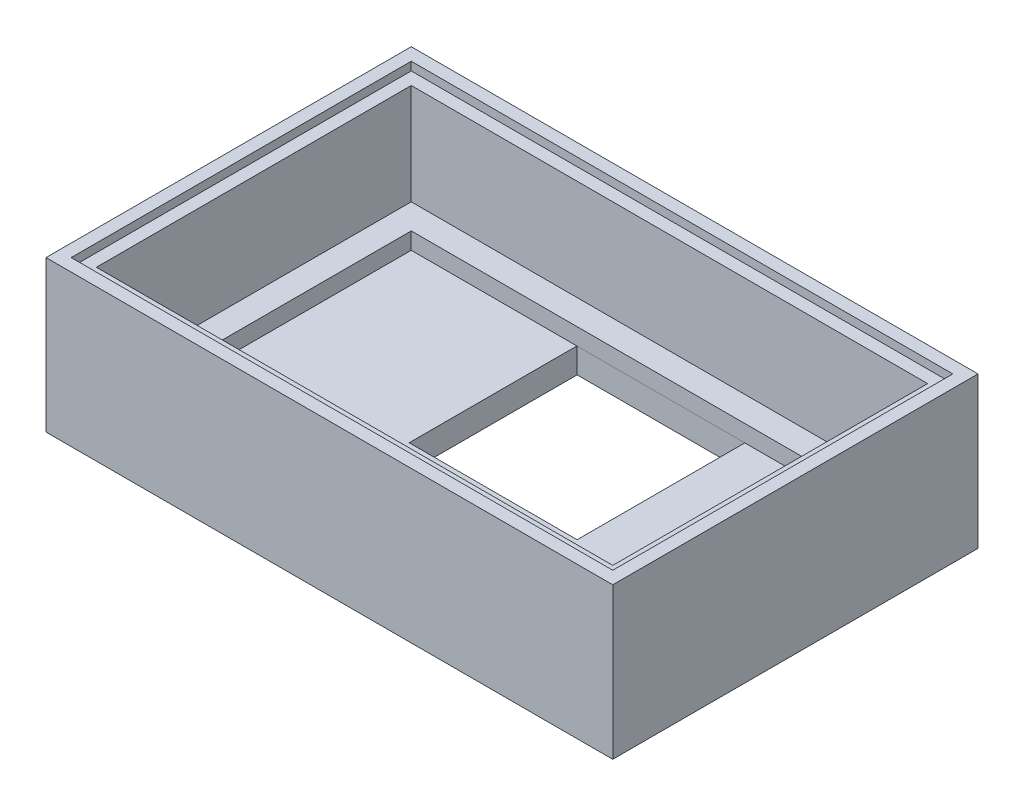
ISO-10303-21;
HEADER;
FILE_DESCRIPTION(('STEP AP214'),'2;1');
FILE_NAME('part.step','',(''),(''),'','','');
FILE_SCHEMA(('AUTOMOTIVE_DESIGN { 1 0 10303 214 1 1 1 1 }'));
ENDSEC;
DATA;
#1=APPLICATION_CONTEXT('core data for automotive mechanical design processes');
#2=APPLICATION_PROTOCOL_DEFINITION('international standard','automotive_design',2000,#1);
#3=PRODUCT_CONTEXT('',#1,'mechanical');
#4=PRODUCT('Part','Part','',(#3));
#5=PRODUCT_RELATED_PRODUCT_CATEGORY('part','',(#4));
#6=PRODUCT_DEFINITION_FORMATION('','',#4);
#7=PRODUCT_DEFINITION_CONTEXT('part definition',#1,'design');
#8=PRODUCT_DEFINITION('design','',#6,#7);
#9=PRODUCT_DEFINITION_SHAPE('','',#8);
#10=(LENGTH_UNIT() NAMED_UNIT(*) SI_UNIT(.MILLI.,.METRE.));
#11=(NAMED_UNIT(*) PLANE_ANGLE_UNIT() SI_UNIT($,.RADIAN.));
#12=(NAMED_UNIT(*) SI_UNIT($,.STERADIAN.) SOLID_ANGLE_UNIT());
#13=UNCERTAINTY_MEASURE_WITH_UNIT(LENGTH_MEASURE(1.E-05),#10,'distance_accuracy_value','');
#14=(GEOMETRIC_REPRESENTATION_CONTEXT(3) GLOBAL_UNCERTAINTY_ASSIGNED_CONTEXT((#13)) GLOBAL_UNIT_ASSIGNED_CONTEXT((#10,
#11,#12)) REPRESENTATION_CONTEXT('',''));
#15=CARTESIAN_POINT('',(0.,0.,0.));
#16=DIRECTION('',(0.,0.,1.));
#17=DIRECTION('',(1.,0.,0.));
#18=AXIS2_PLACEMENT_3D('',#15,#16,#17);
#19=CARTESIAN_POINT('',(-59.1872601006215,15.,0.0820946037709573));
#20=DIRECTION('',(1.,0.,0.));
#21=DIRECTION('',(0.,0.,-1.));
#22=AXIS2_PLACEMENT_3D('',#19,#20,#21);
#23=PLANE('',#22);
#24=DIRECTION('',(0.,-1.,0.));
#25=VECTOR('',#24,1.);
#26=CARTESIAN_POINT('',(-59.1872601006215,15.,0.0820946037709573));
#27=LINE('',#26,#25);
#28=CARTESIAN_POINT('',(-59.1872601006215,14.,0.0820946037709573));
#29=VERTEX_POINT('',#28);
#30=CARTESIAN_POINT('',(-59.1872601006215,2.,0.0820946037709573));
#31=VERTEX_POINT('',#30);
#32=EDGE_CURVE('E375',#29,#31,#27,.T.);
#33=ORIENTED_EDGE('',*,*,#32,.F.);
#34=DIRECTION('',(0.,0.,1.));
#35=VECTOR('',#34,1.);
#36=CARTESIAN_POINT('',(-59.1872601006215,14.,0.0820946037709573));
#37=LINE('',#36,#35);
#38=CARTESIAN_POINT('',(-59.1872601006215,14.,37.5820946037689));
#39=VERTEX_POINT('',#38);
#40=EDGE_CURVE('E325',#29,#39,#37,.T.);
#41=ORIENTED_EDGE('',*,*,#40,.T.);
#42=DIRECTION('',(0.,-1.,0.));
#43=VECTOR('',#42,1.);
#44=CARTESIAN_POINT('',(-59.1872601006215,15.,37.5820946037689));
#45=LINE('',#44,#43);
#46=CARTESIAN_POINT('',(-59.1872601006215,2.,37.5820946037689));
#47=VERTEX_POINT('',#46);
#48=EDGE_CURVE('E378',#39,#47,#45,.T.);
#49=ORIENTED_EDGE('',*,*,#48,.T.);
#50=DIRECTION('',(0.,0.,1.));
#51=VECTOR('',#50,1.);
#52=CARTESIAN_POINT('',(-59.1872601006215,2.,0.0820946037709573));
#53=LINE('',#52,#51);
#54=EDGE_CURVE('E91',#31,#47,#53,.T.);
#55=ORIENTED_EDGE('',*,*,#54,.F.);
#56=EDGE_LOOP('',(#33,#41,#49,#55));
#57=FACE_BOUND('',#56,.T.);
#58=ADVANCED_FACE('F83',(#57),#23,.T.);
#59=CARTESIAN_POINT('',(2.31273989937717,15.,0.0820946037709573));
#60=DIRECTION('',(1.,0.,0.));
#61=DIRECTION('',(0.,0.,-1.));
#62=AXIS2_PLACEMENT_3D('',#59,#60,#61);
#63=PLANE('',#62);
#64=DIRECTION('',(0.,0.,1.));
#65=VECTOR('',#64,1.);
#66=CARTESIAN_POINT('',(2.31273989937717,14.,0.0820946037709573));
#67=LINE('',#66,#65);
#68=CARTESIAN_POINT('',(2.31273989937717,14.,0.0820946037709573));
#69=VERTEX_POINT('',#68);
#70=CARTESIAN_POINT('',(2.31273989937719,14.,37.5820946037689));
#71=VERTEX_POINT('',#70);
#72=EDGE_CURVE('E317',#69,#71,#67,.T.);
#73=ORIENTED_EDGE('',*,*,#72,.F.);
#74=DIRECTION('',(0.,-1.,0.));
#75=VECTOR('',#74,1.);
#76=CARTESIAN_POINT('',(2.31273989937717,15.,0.0820946037709573));
#77=LINE('',#76,#75);
#78=CARTESIAN_POINT('',(2.31273989937717,2.,0.0820946037709573));
#79=VERTEX_POINT('',#78);
#80=EDGE_CURVE('E374',#69,#79,#77,.T.);
#81=ORIENTED_EDGE('',*,*,#80,.T.);
#82=DIRECTION('',(0.,0.,1.));
#83=VECTOR('',#82,1.);
#84=CARTESIAN_POINT('',(2.31273989937717,2.,0.0820946037709573));
#85=LINE('',#84,#83);
#86=CARTESIAN_POINT('',(2.31273989937719,2.,37.5820946037689));
#87=VERTEX_POINT('',#86);
#88=EDGE_CURVE('E437',#79,#87,#85,.T.);
#89=ORIENTED_EDGE('',*,*,#88,.T.);
#90=DIRECTION('',(0.,-1.,0.));
#91=VECTOR('',#90,1.);
#92=CARTESIAN_POINT('',(2.31273989937719,15.,37.5820946037689));
#93=LINE('',#92,#91);
#94=EDGE_CURVE('E380',#71,#87,#93,.T.);
#95=ORIENTED_EDGE('',*,*,#94,.F.);
#96=EDGE_LOOP('',(#73,#81,#89,#95));
#97=FACE_BOUND('',#96,.T.);
#98=ADVANCED_FACE('F457',(#97),#63,.F.);
#99=CARTESIAN_POINT('',(-59.1872601006215,15.,0.0820946037709573));
#100=DIRECTION('',(0.,0.,-1.));
#101=DIRECTION('',(-1.,0.,0.));
#102=AXIS2_PLACEMENT_3D('',#99,#100,#101);
#103=PLANE('',#102);
#104=DIRECTION('',(1.,0.,0.));
#105=VECTOR('',#104,1.);
#106=CARTESIAN_POINT('',(-59.1872601006215,14.,0.0820946037709573));
#107=LINE('',#106,#105);
#108=EDGE_CURVE('E328',#29,#69,#107,.T.);
#109=ORIENTED_EDGE('',*,*,#108,.F.);
#110=ORIENTED_EDGE('',*,*,#32,.T.);
#111=DIRECTION('',(1.,0.,0.));
#112=VECTOR('',#111,1.);
#113=CARTESIAN_POINT('',(-59.1872601006215,2.,0.0820946037709573));
#114=LINE('',#113,#112);
#115=EDGE_CURVE('E434',#31,#79,#114,.T.);
#116=ORIENTED_EDGE('',*,*,#115,.T.);
#117=ORIENTED_EDGE('',*,*,#80,.F.);
#118=EDGE_LOOP('',(#109,#110,#116,#117));
#119=FACE_BOUND('',#118,.T.);
#120=ADVANCED_FACE('F461',(#119),#103,.F.);
#121=CARTESIAN_POINT('',(-59.1872601006215,15.,37.5820946037689));
#122=DIRECTION('',(0.,0.,-1.));
#123=DIRECTION('',(-1.,0.,0.));
#124=AXIS2_PLACEMENT_3D('',#121,#122,#123);
#125=PLANE('',#124);
#126=ORIENTED_EDGE('',*,*,#48,.F.);
#127=DIRECTION('',(1.,0.,0.));
#128=VECTOR('',#127,1.);
#129=CARTESIAN_POINT('',(-59.1872601006215,14.,37.5820946037689));
#130=LINE('',#129,#128);
#131=EDGE_CURVE('E12',#39,#71,#130,.T.);
#132=ORIENTED_EDGE('',*,*,#131,.T.);
#133=ORIENTED_EDGE('',*,*,#94,.T.);
#134=DIRECTION('',(1.,0.,0.));
#135=VECTOR('',#134,1.);
#136=CARTESIAN_POINT('',(-59.1872601006215,2.,37.5820946037689));
#137=LINE('',#136,#135);
#138=EDGE_CURVE('E440',#47,#87,#137,.T.);
#139=ORIENTED_EDGE('',*,*,#138,.F.);
#140=EDGE_LOOP('',(#126,#132,#133,#139));
#141=FACE_BOUND('',#140,.T.);
#142=ADVANCED_FACE('F453',(#141),#125,.T.);
#143=CARTESIAN_POINT('',(0.,-3.,0.));
#144=DIRECTION('',(0.,1.,0.));
#145=DIRECTION('',(0.,0.,1.));
#146=AXIS2_PLACEMENT_3D('',#143,#144,#145);
#147=PLANE('',#146);
#148=DIRECTION('',(-1.,0.,0.));
#149=VECTOR('',#148,1.);
#150=CARTESIAN_POINT('',(-36.4581734004143,-3.,3.05472973584662));
#151=LINE('',#150,#149);
#152=CARTESIAN_POINT('',(-16.4581734004143,-3.,3.05472973584662));
#153=VERTEX_POINT('',#152);
#154=CARTESIAN_POINT('',(-36.4581734004143,-3.,3.05472973584662));
#155=VERTEX_POINT('',#154);
#156=EDGE_CURVE('E262',#153,#155,#151,.T.);
#157=ORIENTED_EDGE('',*,*,#156,.T.);
#158=DIRECTION('',(0.,0.,1.));
#159=VECTOR('',#158,1.);
#160=CARTESIAN_POINT('',(-36.4581734004143,-3.,3.05472973584662));
#161=LINE('',#160,#159);
#162=CARTESIAN_POINT('',(-36.4581734004143,-3.,23.0547297358466));
#163=VERTEX_POINT('',#162);
#164=EDGE_CURVE('E254',#155,#163,#161,.T.);
#165=ORIENTED_EDGE('',*,*,#164,.T.);
#166=DIRECTION('',(1.,0.,0.));
#167=VECTOR('',#166,1.);
#168=CARTESIAN_POINT('',(-36.4581734004143,-3.,23.0547297358466));
#169=LINE('',#168,#167);
#170=CARTESIAN_POINT('',(-16.4581734004143,-3.,23.0547297358466));
#171=VERTEX_POINT('',#170);
#172=EDGE_CURVE('E265',#163,#171,#169,.T.);
#173=ORIENTED_EDGE('',*,*,#172,.T.);
#174=DIRECTION('',(0.,0.,-1.));
#175=VECTOR('',#174,1.);
#176=CARTESIAN_POINT('',(-16.4581734004143,-3.,3.05472973584662));
#177=LINE('',#176,#175);
#178=EDGE_CURVE('E98',#171,#153,#177,.T.);
#179=ORIENTED_EDGE('',*,*,#178,.T.);
#180=EDGE_LOOP('',(#157,#165,#173,#179));
#181=FACE_BOUND('',#180,.T.);
#182=DIRECTION('',(0.,0.,1.));
#183=VECTOR('',#182,1.);
#184=CARTESIAN_POINT('',(-62.1872601006215,-3.,-2.91790539622904));
#185=LINE('',#184,#183);
#186=CARTESIAN_POINT('',(-62.1872601006215,-3.,-2.91790539622904));
#187=VERTEX_POINT('',#186);
#188=CARTESIAN_POINT('',(-62.1872601006215,-3.,40.5820946037689));
#189=VERTEX_POINT('',#188);
#190=EDGE_CURVE('E362',#187,#189,#185,.T.);
#191=ORIENTED_EDGE('',*,*,#190,.F.);
#192=DIRECTION('',(1.,0.,0.));
#193=VECTOR('',#192,1.);
#194=CARTESIAN_POINT('',(-62.1872601006215,-3.,-2.91790539622904));
#195=LINE('',#194,#193);
#196=CARTESIAN_POINT('',(5.31273989937717,-3.,-2.91790539622904));
#197=VERTEX_POINT('',#196);
#198=EDGE_CURVE('E371',#187,#197,#195,.T.);
#199=ORIENTED_EDGE('',*,*,#198,.T.);
#200=DIRECTION('',(0.,0.,1.));
#201=VECTOR('',#200,1.);
#202=CARTESIAN_POINT('',(5.31273989937717,-3.,-2.91790539622904));
#203=LINE('',#202,#201);
#204=CARTESIAN_POINT('',(5.31273989937717,-3.,40.5820946037689));
#205=VERTEX_POINT('',#204);
#206=EDGE_CURVE('E368',#197,#205,#203,.T.);
#207=ORIENTED_EDGE('',*,*,#206,.T.);
#208=DIRECTION('',(1.,0.,0.));
#209=VECTOR('',#208,1.);
#210=CARTESIAN_POINT('',(-62.1872601006215,-3.,40.5820946037689));
#211=LINE('',#210,#209);
#212=EDGE_CURVE('E365',#189,#205,#211,.T.);
#213=ORIENTED_EDGE('',*,*,#212,.F.);
#214=EDGE_LOOP('',(#191,#199,#207,#213));
#215=FACE_BOUND('',#214,.T.);
#216=DIRECTION('',(0.,0.,1.));
#217=VECTOR('',#216,1.);
#218=CARTESIAN_POINT('',(-9.68726010062283,-3.,0.));
#219=LINE('',#218,#217);
#220=CARTESIAN_POINT('',(-9.68726010062283,-3.,30.5320946037689));
#221=VERTEX_POINT('',#220);
#222=CARTESIAN_POINT('',(-9.68726010062283,-3.,35.0320946037689));
#223=VERTEX_POINT('',#222);
#224=EDGE_CURVE('E335',#221,#223,#219,.T.);
#225=ORIENTED_EDGE('',*,*,#224,.T.);
#226=DIRECTION('',(1.,0.,0.));
#227=VECTOR('',#226,1.);
#228=CARTESIAN_POINT('',(0.,-3.,35.0320946037689));
#229=LINE('',#228,#227);
#230=CARTESIAN_POINT('',(-5.18726010062283,-3.,35.0320946037689));
#231=VERTEX_POINT('',#230);
#232=EDGE_CURVE('E353',#223,#231,#229,.T.);
#233=ORIENTED_EDGE('',*,*,#232,.T.);
#234=DIRECTION('',(0.,0.,1.));
#235=VECTOR('',#234,1.);
#236=CARTESIAN_POINT('',(-5.18726010062283,-3.,0.));
#237=LINE('',#236,#235);
#238=CARTESIAN_POINT('',(-5.18726010062283,-3.,30.5320946037689));
#239=VERTEX_POINT('',#238);
#240=EDGE_CURVE('E330',#239,#231,#237,.T.);
#241=ORIENTED_EDGE('',*,*,#240,.F.);
#242=DIRECTION('',(1.,0.,0.));
#243=VECTOR('',#242,1.);
#244=CARTESIAN_POINT('',(0.,-3.,30.5320946037689));
#245=LINE('',#244,#243);
#246=EDGE_CURVE('E333',#221,#239,#245,.T.);
#247=ORIENTED_EDGE('',*,*,#246,.F.);
#248=EDGE_LOOP('',(#225,#233,#241,#247));
#249=FACE_BOUND('',#248,.T.);
#250=ADVANCED_FACE('F269',(#181,#215,#249),#147,.F.);
#251=CARTESIAN_POINT('',(0.,0.,0.));
#252=DIRECTION('',(0.,1.,0.));
#253=DIRECTION('',(0.,0.,1.));
#254=AXIS2_PLACEMENT_3D('',#251,#252,#253);
#255=PLANE('',#254);
#256=DIRECTION('',(0.,0.,1.));
#257=VECTOR('',#256,1.);
#258=CARTESIAN_POINT('',(-36.4581734004143,0.,3.05472973584662));
#259=LINE('',#258,#257);
#260=CARTESIAN_POINT('',(-36.4581734004143,0.,3.08209460377096));
#261=VERTEX_POINT('',#260);
#262=CARTESIAN_POINT('',(-36.4581734004143,0.,23.0547297358466));
#263=VERTEX_POINT('',#262);
#264=EDGE_CURVE('E257',#261,#263,#259,.T.);
#265=ORIENTED_EDGE('',*,*,#264,.F.);
#266=DIRECTION('',(1.,0.,0.));
#267=VECTOR('',#266,1.);
#268=CARTESIAN_POINT('',(-56.1872601006215,0.,3.08209460377096));
#269=LINE('',#268,#267);
#270=CARTESIAN_POINT('',(-56.1872601006215,0.,3.08209460377096));
#271=VERTEX_POINT('',#270);
#272=EDGE_CURVE('E404',#271,#261,#269,.T.);
#273=ORIENTED_EDGE('',*,*,#272,.F.);
#274=DIRECTION('',(0.,0.,1.));
#275=VECTOR('',#274,1.);
#276=CARTESIAN_POINT('',(-56.1872601006215,0.,3.08209460377096));
#277=LINE('',#276,#275);
#278=CARTESIAN_POINT('',(-56.1872601006215,0.,36.0820946037689));
#279=VERTEX_POINT('',#278);
#280=EDGE_CURVE('E395',#271,#279,#277,.T.);
#281=ORIENTED_EDGE('',*,*,#280,.T.);
#282=DIRECTION('',(1.,0.,0.));
#283=VECTOR('',#282,1.);
#284=CARTESIAN_POINT('',(-56.1872601006215,0.,36.0820946037689));
#285=LINE('',#284,#283);
#286=CARTESIAN_POINT('',(-0.687260100622811,0.,36.0820946037689));
#287=VERTEX_POINT('',#286);
#288=EDGE_CURVE('E414',#279,#287,#285,.T.);
#289=ORIENTED_EDGE('',*,*,#288,.T.);
#290=DIRECTION('',(0.,0.,1.));
#291=VECTOR('',#290,1.);
#292=CARTESIAN_POINT('',(-0.687260100622825,0.,3.08209460377096));
#293=LINE('',#292,#291);
#294=CARTESIAN_POINT('',(-0.687260100622825,0.,3.08209460377096));
#295=VERTEX_POINT('',#294);
#296=EDGE_CURVE('E416',#295,#287,#293,.T.);
#297=ORIENTED_EDGE('',*,*,#296,.F.);
#298=CARTESIAN_POINT('',(-16.4581734004143,0.,3.08209460377096));
#299=VERTEX_POINT('',#298);
#300=EDGE_CURVE('E419',#299,#295,#269,.T.);
#301=ORIENTED_EDGE('',*,*,#300,.F.);
#302=DIRECTION('',(0.,0.,-1.));
#303=VECTOR('',#302,1.);
#304=CARTESIAN_POINT('',(-16.4581734004143,0.,3.05472973584662));
#305=LINE('',#304,#303);
#306=CARTESIAN_POINT('',(-16.4581734004143,0.,23.0547297358466));
#307=VERTEX_POINT('',#306);
#308=EDGE_CURVE('E104',#307,#299,#305,.T.);
#309=ORIENTED_EDGE('',*,*,#308,.F.);
#310=DIRECTION('',(1.,0.,0.));
#311=VECTOR('',#310,1.);
#312=CARTESIAN_POINT('',(-36.4581734004143,0.,23.0547297358466));
#313=LINE('',#312,#311);
#314=EDGE_CURVE('E281',#263,#307,#313,.T.);
#315=ORIENTED_EDGE('',*,*,#314,.F.);
#316=EDGE_LOOP('',(#265,#273,#281,#289,#297,#301,#309,#315));
#317=FACE_BOUND('',#316,.T.);
#318=DIRECTION('',(-1.,0.,0.));
#319=VECTOR('',#318,1.);
#320=CARTESIAN_POINT('',(0.,0.,35.0320946037689));
#321=LINE('',#320,#319);
#322=CARTESIAN_POINT('',(-5.18726010062283,0.,35.0320946037689));
#323=VERTEX_POINT('',#322);
#324=CARTESIAN_POINT('',(-9.68726010062283,0.,35.0320946037689));
#325=VERTEX_POINT('',#324);
#326=EDGE_CURVE('E341',#323,#325,#321,.T.);
#327=ORIENTED_EDGE('',*,*,#326,.T.);
#328=DIRECTION('',(0.,0.,-1.));
#329=VECTOR('',#328,1.);
#330=CARTESIAN_POINT('',(-9.68726010062283,0.,0.));
#331=LINE('',#330,#329);
#332=CARTESIAN_POINT('',(-9.68726010062283,0.,30.5320946037689));
#333=VERTEX_POINT('',#332);
#334=EDGE_CURVE('E338',#325,#333,#331,.T.);
#335=ORIENTED_EDGE('',*,*,#334,.T.);
#336=DIRECTION('',(-1.,0.,0.));
#337=VECTOR('',#336,1.);
#338=CARTESIAN_POINT('',(0.,0.,30.5320946037689));
#339=LINE('',#338,#337);
#340=CARTESIAN_POINT('',(-5.18726010062283,0.,30.5320946037689));
#341=VERTEX_POINT('',#340);
#342=EDGE_CURVE('E347',#341,#333,#339,.T.);
#343=ORIENTED_EDGE('',*,*,#342,.F.);
#344=DIRECTION('',(0.,0.,-1.));
#345=VECTOR('',#344,1.);
#346=CARTESIAN_POINT('',(-5.18726010062283,0.,0.));
#347=LINE('',#346,#345);
#348=EDGE_CURVE('E344',#323,#341,#347,.T.);
#349=ORIENTED_EDGE('',*,*,#348,.F.);
#350=EDGE_LOOP('',(#327,#335,#343,#349));
#351=FACE_BOUND('',#350,.T.);
#352=ADVANCED_FACE('F489',(#317,#351),#255,.T.);
#353=CARTESIAN_POINT('',(0.,2.,0.));
#354=DIRECTION('',(0.,-1.,0.));
#355=DIRECTION('',(0.,0.,-1.));
#356=AXIS2_PLACEMENT_3D('',#353,#354,#355);
#357=PLANE('',#356);
#358=ORIENTED_EDGE('',*,*,#115,.F.);
#359=ORIENTED_EDGE('',*,*,#54,.T.);
#360=ORIENTED_EDGE('',*,*,#138,.T.);
#361=ORIENTED_EDGE('',*,*,#88,.F.);
#362=EDGE_LOOP('',(#358,#359,#360,#361));
#363=FACE_BOUND('',#362,.T.);
#364=DIRECTION('',(0.,0.,1.));
#365=VECTOR('',#364,1.);
#366=CARTESIAN_POINT('',(-56.1872601006215,2.,3.08209460377096));
#367=LINE('',#366,#365);
#368=CARTESIAN_POINT('',(-56.1872601006215,2.,3.08209460377096));
#369=VERTEX_POINT('',#368);
#370=CARTESIAN_POINT('',(-56.1872601006215,2.,36.0820946037689));
#371=VERTEX_POINT('',#370);
#372=EDGE_CURVE('E401',#369,#371,#367,.T.);
#373=ORIENTED_EDGE('',*,*,#372,.F.);
#374=DIRECTION('',(1.,0.,0.));
#375=VECTOR('',#374,1.);
#376=CARTESIAN_POINT('',(-56.1872601006215,2.,3.08209460377096));
#377=LINE('',#376,#375);
#378=CARTESIAN_POINT('',(-0.687260100622825,2.,3.08209460377096));
#379=VERTEX_POINT('',#378);
#380=EDGE_CURVE('E409',#369,#379,#377,.T.);
#381=ORIENTED_EDGE('',*,*,#380,.T.);
#382=DIRECTION('',(0.,0.,1.));
#383=VECTOR('',#382,1.);
#384=CARTESIAN_POINT('',(-0.687260100622825,2.,3.08209460377096));
#385=LINE('',#384,#383);
#386=CARTESIAN_POINT('',(-0.687260100622811,2.,36.0820946037689));
#387=VERTEX_POINT('',#386);
#388=EDGE_CURVE('E406',#379,#387,#385,.T.);
#389=ORIENTED_EDGE('',*,*,#388,.T.);
#390=DIRECTION('',(1.,0.,0.));
#391=VECTOR('',#390,1.);
#392=CARTESIAN_POINT('',(-56.1872601006215,2.,36.0820946037689));
#393=LINE('',#392,#391);
#394=EDGE_CURVE('E403',#371,#387,#393,.T.);
#395=ORIENTED_EDGE('',*,*,#394,.F.);
#396=EDGE_LOOP('',(#373,#381,#389,#395));
#397=FACE_BOUND('',#396,.T.);
#398=ADVANCED_FACE('F85',(#363,#397),#357,.F.);
#399=CARTESIAN_POINT('',(-56.1872601006215,2.,3.08209460377096));
#400=DIRECTION('',(1.,0.,0.));
#401=DIRECTION('',(0.,0.,-1.));
#402=AXIS2_PLACEMENT_3D('',#399,#400,#401);
#403=PLANE('',#402);
#404=ORIENTED_EDGE('',*,*,#280,.F.);
#405=DIRECTION('',(0.,-1.,0.));
#406=VECTOR('',#405,1.);
#407=CARTESIAN_POINT('',(-56.1872601006215,2.,3.08209460377096));
#408=LINE('',#407,#406);
#409=EDGE_CURVE('E412',#369,#271,#408,.T.);
#410=ORIENTED_EDGE('',*,*,#409,.F.);
#411=ORIENTED_EDGE('',*,*,#372,.T.);
#412=DIRECTION('',(0.,-1.,0.));
#413=VECTOR('',#412,1.);
#414=CARTESIAN_POINT('',(-56.1872601006215,2.,36.0820946037689));
#415=LINE('',#414,#413);
#416=EDGE_CURVE('E431',#371,#279,#415,.T.);
#417=ORIENTED_EDGE('',*,*,#416,.T.);
#418=EDGE_LOOP('',(#404,#410,#411,#417));
#419=FACE_BOUND('',#418,.T.);
#420=ADVANCED_FACE('F526',(#419),#403,.T.);
#421=CARTESIAN_POINT('',(-56.1872601006215,2.,36.0820946037689));
#422=DIRECTION('',(0.,0.,-1.));
#423=DIRECTION('',(-1.,0.,0.));
#424=AXIS2_PLACEMENT_3D('',#421,#422,#423);
#425=PLANE('',#424);
#426=ORIENTED_EDGE('',*,*,#288,.F.);
#427=ORIENTED_EDGE('',*,*,#416,.F.);
#428=ORIENTED_EDGE('',*,*,#394,.T.);
#429=DIRECTION('',(0.,-1.,0.));
#430=VECTOR('',#429,1.);
#431=CARTESIAN_POINT('',(-0.687260100622811,2.,36.0820946037689));
#432=LINE('',#431,#430);
#433=EDGE_CURVE('E428',#387,#287,#432,.T.);
#434=ORIENTED_EDGE('',*,*,#433,.T.);
#435=EDGE_LOOP('',(#426,#427,#428,#434));
#436=FACE_BOUND('',#435,.T.);
#437=ADVANCED_FACE('F523',(#436),#425,.T.);
#438=CARTESIAN_POINT('',(-0.687260100622825,2.,3.08209460377096));
#439=DIRECTION('',(1.,0.,0.));
#440=DIRECTION('',(0.,0.,-1.));
#441=AXIS2_PLACEMENT_3D('',#438,#439,#440);
#442=PLANE('',#441);
#443=ORIENTED_EDGE('',*,*,#296,.T.);
#444=ORIENTED_EDGE('',*,*,#433,.F.);
#445=ORIENTED_EDGE('',*,*,#388,.F.);
#446=DIRECTION('',(0.,-1.,0.));
#447=VECTOR('',#446,1.);
#448=CARTESIAN_POINT('',(-0.687260100622825,2.,3.08209460377096));
#449=LINE('',#448,#447);
#450=EDGE_CURVE('E425',#379,#295,#449,.T.);
#451=ORIENTED_EDGE('',*,*,#450,.T.);
#452=EDGE_LOOP('',(#443,#444,#445,#451));
#453=FACE_BOUND('',#452,.T.);
#454=ADVANCED_FACE('F519',(#453),#442,.F.);
#455=CARTESIAN_POINT('',(-56.1872601006215,2.,3.08209460377096));
#456=DIRECTION('',(0.,0.,-1.));
#457=DIRECTION('',(-1.,0.,0.));
#458=AXIS2_PLACEMENT_3D('',#455,#456,#457);
#459=PLANE('',#458);
#460=ORIENTED_EDGE('',*,*,#272,.T.);
#461=EDGE_CURVE('E422',#261,#299,#269,.T.);
#462=ORIENTED_EDGE('',*,*,#461,.T.);
#463=ORIENTED_EDGE('',*,*,#300,.T.);
#464=ORIENTED_EDGE('',*,*,#450,.F.);
#465=ORIENTED_EDGE('',*,*,#380,.F.);
#466=ORIENTED_EDGE('',*,*,#409,.T.);
#467=EDGE_LOOP('',(#460,#462,#463,#464,#465,#466));
#468=FACE_BOUND('',#467,.T.);
#469=ADVANCED_FACE('F515',(#468),#459,.F.);
#470=CARTESIAN_POINT('',(-62.1872601006215,15.,-2.91790539622904));
#471=DIRECTION('',(0.,0.,-1.));
#472=DIRECTION('',(-1.,0.,0.));
#473=AXIS2_PLACEMENT_3D('',#470,#471,#472);
#474=PLANE('',#473);
#475=DIRECTION('',(0.,-1.,0.));
#476=VECTOR('',#475,1.);
#477=CARTESIAN_POINT('',(5.31273989937717,15.,-2.91790539622904));
#478=LINE('',#477,#476);
#479=CARTESIAN_POINT('',(5.31273989937717,15.,-2.91790539622904));
#480=VERTEX_POINT('',#479);
#481=EDGE_CURVE('E392',#480,#197,#478,.T.);
#482=ORIENTED_EDGE('',*,*,#481,.T.);
#483=ORIENTED_EDGE('',*,*,#198,.F.);
#484=DIRECTION('',(0.,-1.,0.));
#485=VECTOR('',#484,1.);
#486=CARTESIAN_POINT('',(-62.1872601006215,15.,-2.91790539622904));
#487=LINE('',#486,#485);
#488=CARTESIAN_POINT('',(-62.1872601006215,15.,-2.91790539622904));
#489=VERTEX_POINT('',#488);
#490=EDGE_CURVE('E393',#489,#187,#487,.T.);
#491=ORIENTED_EDGE('',*,*,#490,.F.);
#492=DIRECTION('',(1.,0.,0.));
#493=VECTOR('',#492,1.);
#494=CARTESIAN_POINT('',(-62.1872601006215,15.,-2.91790539622904));
#495=LINE('',#494,#493);
#496=EDGE_CURVE('E377',#489,#480,#495,.T.);
#497=ORIENTED_EDGE('',*,*,#496,.T.);
#498=EDGE_LOOP('',(#482,#483,#491,#497));
#499=FACE_BOUND('',#498,.T.);
#500=ADVANCED_FACE('F505',(#499),#474,.T.);
#501=CARTESIAN_POINT('',(-62.1872601006215,15.,-2.91790539622904));
#502=DIRECTION('',(1.,0.,0.));
#503=DIRECTION('',(0.,0.,-1.));
#504=AXIS2_PLACEMENT_3D('',#501,#502,#503);
#505=PLANE('',#504);
#506=ORIENTED_EDGE('',*,*,#490,.T.);
#507=ORIENTED_EDGE('',*,*,#190,.T.);
#508=DIRECTION('',(0.,-1.,0.));
#509=VECTOR('',#508,1.);
#510=CARTESIAN_POINT('',(-62.1872601006215,15.,40.5820946037689));
#511=LINE('',#510,#509);
#512=CARTESIAN_POINT('',(-62.1872601006215,15.,40.5820946037689));
#513=VERTEX_POINT('',#512);
#514=EDGE_CURVE('E396',#513,#189,#511,.T.);
#515=ORIENTED_EDGE('',*,*,#514,.F.);
#516=DIRECTION('',(0.,0.,1.));
#517=VECTOR('',#516,1.);
#518=CARTESIAN_POINT('',(-62.1872601006215,15.,-2.91790539622904));
#519=LINE('',#518,#517);
#520=EDGE_CURVE('E390',#489,#513,#519,.T.);
#521=ORIENTED_EDGE('',*,*,#520,.F.);
#522=EDGE_LOOP('',(#506,#507,#515,#521));
#523=FACE_BOUND('',#522,.T.);
#524=ADVANCED_FACE('F501',(#523),#505,.F.);
#525=CARTESIAN_POINT('',(-62.1872601006215,15.,40.5820946037689));
#526=DIRECTION('',(0.,0.,-1.));
#527=DIRECTION('',(-1.,0.,0.));
#528=AXIS2_PLACEMENT_3D('',#525,#526,#527);
#529=PLANE('',#528);
#530=ORIENTED_EDGE('',*,*,#514,.T.);
#531=ORIENTED_EDGE('',*,*,#212,.T.);
#532=DIRECTION('',(0.,-1.,0.));
#533=VECTOR('',#532,1.);
#534=CARTESIAN_POINT('',(5.31273989937717,15.,40.5820946037689));
#535=LINE('',#534,#533);
#536=CARTESIAN_POINT('',(5.31273989937717,15.,40.5820946037689));
#537=VERTEX_POINT('',#536);
#538=EDGE_CURVE('E398',#537,#205,#535,.T.);
#539=ORIENTED_EDGE('',*,*,#538,.F.);
#540=DIRECTION('',(1.,0.,0.));
#541=VECTOR('',#540,1.);
#542=CARTESIAN_POINT('',(-62.1872601006215,15.,40.5820946037689));
#543=LINE('',#542,#541);
#544=EDGE_CURVE('E388',#513,#537,#543,.T.);
#545=ORIENTED_EDGE('',*,*,#544,.F.);
#546=EDGE_LOOP('',(#530,#531,#539,#545));
#547=FACE_BOUND('',#546,.T.);
#548=ADVANCED_FACE('F504',(#547),#529,.F.);
#549=CARTESIAN_POINT('',(5.31273989937717,15.,-2.91790539622904));
#550=DIRECTION('',(1.,0.,0.));
#551=DIRECTION('',(0.,0.,-1.));
#552=AXIS2_PLACEMENT_3D('',#549,#550,#551);
#553=PLANE('',#552);
#554=ORIENTED_EDGE('',*,*,#538,.T.);
#555=ORIENTED_EDGE('',*,*,#206,.F.);
#556=ORIENTED_EDGE('',*,*,#481,.F.);
#557=DIRECTION('',(0.,0.,1.));
#558=VECTOR('',#557,1.);
#559=CARTESIAN_POINT('',(5.31273989937717,15.,-2.91790539622904));
#560=LINE('',#559,#558);
#561=EDGE_CURVE('E385',#480,#537,#560,.T.);
#562=ORIENTED_EDGE('',*,*,#561,.T.);
#563=EDGE_LOOP('',(#554,#555,#556,#562));
#564=FACE_BOUND('',#563,.T.);
#565=ADVANCED_FACE('F499',(#564),#553,.T.);
#566=CARTESIAN_POINT('',(0.,15.,0.));
#567=DIRECTION('',(0.,-1.,0.));
#568=DIRECTION('',(0.,0.,-1.));
#569=AXIS2_PLACEMENT_3D('',#566,#567,#568);
#570=PLANE('',#569);
#571=DIRECTION('',(1.,0.,0.));
#572=VECTOR('',#571,1.);
#573=CARTESIAN_POINT('',(-60.6872601006215,15.,39.0820946037689));
#574=LINE('',#573,#572);
#575=CARTESIAN_POINT('',(-60.6872601006215,15.,39.0820946037689));
#576=VERTEX_POINT('',#575);
#577=CARTESIAN_POINT('',(3.81273989937719,15.,39.0820946037689));
#578=VERTEX_POINT('',#577);
#579=EDGE_CURVE('E307',#576,#578,#574,.T.);
#580=ORIENTED_EDGE('',*,*,#579,.F.);
#581=DIRECTION('',(0.,0.,1.));
#582=VECTOR('',#581,1.);
#583=CARTESIAN_POINT('',(-60.6872601006215,15.,-1.41790539622904));
#584=LINE('',#583,#582);
#585=CARTESIAN_POINT('',(-60.6872601006215,15.,-1.41790539622904));
#586=VERTEX_POINT('',#585);
#587=EDGE_CURVE('E287',#586,#576,#584,.T.);
#588=ORIENTED_EDGE('',*,*,#587,.F.);
#589=DIRECTION('',(-1.,0.,0.));
#590=VECTOR('',#589,1.);
#591=CARTESIAN_POINT('',(3.81273989937717,15.,-1.41790539622904));
#592=LINE('',#591,#590);
#593=CARTESIAN_POINT('',(3.81273989937717,15.,-1.41790539622904));
#594=VERTEX_POINT('',#593);
#595=EDGE_CURVE('E296',#594,#586,#592,.T.);
#596=ORIENTED_EDGE('',*,*,#595,.F.);
#597=DIRECTION('',(0.,0.,-1.));
#598=VECTOR('',#597,1.);
#599=CARTESIAN_POINT('',(3.81273989937719,15.,39.0820946037689));
#600=LINE('',#599,#598);
#601=EDGE_CURVE('E310',#578,#594,#600,.T.);
#602=ORIENTED_EDGE('',*,*,#601,.F.);
#603=EDGE_LOOP('',(#580,#588,#596,#602));
#604=FACE_BOUND('',#603,.T.);
#605=ORIENTED_EDGE('',*,*,#496,.F.);
#606=ORIENTED_EDGE('',*,*,#520,.T.);
#607=ORIENTED_EDGE('',*,*,#544,.T.);
#608=ORIENTED_EDGE('',*,*,#561,.F.);
#609=EDGE_LOOP('',(#605,#606,#607,#608));
#610=FACE_BOUND('',#609,.T.);
#611=ADVANCED_FACE('F495',(#604,#610),#570,.F.);
#612=CARTESIAN_POINT('',(-9.68726010062283,-3.001,0.));
#613=DIRECTION('',(1.,0.,0.));
#614=DIRECTION('',(0.,0.,-1.));
#615=AXIS2_PLACEMENT_3D('',#612,#613,#614);
#616=PLANE('',#615);
#617=DIRECTION('',(0.,1.,0.));
#618=VECTOR('',#617,1.);
#619=CARTESIAN_POINT('',(-9.68726010062283,-3.001,30.5320946037689));
#620=LINE('',#619,#618);
#621=EDGE_CURVE('E351',#221,#333,#620,.T.);
#622=ORIENTED_EDGE('',*,*,#621,.T.);
#623=ORIENTED_EDGE('',*,*,#334,.F.);
#624=DIRECTION('',(0.,1.,0.));
#625=VECTOR('',#624,1.);
#626=CARTESIAN_POINT('',(-9.68726010062283,-3.001,35.0320946037689));
#627=LINE('',#626,#625);
#628=EDGE_CURVE('E350',#223,#325,#627,.T.);
#629=ORIENTED_EDGE('',*,*,#628,.F.);
#630=ORIENTED_EDGE('',*,*,#224,.F.);
#631=EDGE_LOOP('',(#622,#623,#629,#630));
#632=FACE_BOUND('',#631,.T.);
#633=ADVANCED_FACE('F498',(#632),#616,.T.);
#634=CARTESIAN_POINT('',(0.,-3.001,30.5320946037689));
#635=DIRECTION('',(0.,0.,-1.));
#636=DIRECTION('',(-1.,0.,0.));
#637=AXIS2_PLACEMENT_3D('',#634,#635,#636);
#638=PLANE('',#637);
#639=ORIENTED_EDGE('',*,*,#246,.T.);
#640=DIRECTION('',(0.,1.,0.));
#641=VECTOR('',#640,1.);
#642=CARTESIAN_POINT('',(-5.18726010062283,-3.001,30.5320946037689));
#643=LINE('',#642,#641);
#644=EDGE_CURVE('E354',#239,#341,#643,.T.);
#645=ORIENTED_EDGE('',*,*,#644,.T.);
#646=ORIENTED_EDGE('',*,*,#342,.T.);
#647=ORIENTED_EDGE('',*,*,#621,.F.);
#648=EDGE_LOOP('',(#639,#645,#646,#647));
#649=FACE_BOUND('',#648,.T.);
#650=ADVANCED_FACE('F579',(#649),#638,.F.);
#651=CARTESIAN_POINT('',(-5.18726010062283,-3.001,0.));
#652=DIRECTION('',(1.,0.,0.));
#653=DIRECTION('',(0.,0.,-1.));
#654=AXIS2_PLACEMENT_3D('',#651,#652,#653);
#655=PLANE('',#654);
#656=ORIENTED_EDGE('',*,*,#240,.T.);
#657=DIRECTION('',(0.,1.,0.));
#658=VECTOR('',#657,1.);
#659=CARTESIAN_POINT('',(-5.18726010062283,-3.001,35.0320946037689));
#660=LINE('',#659,#658);
#661=EDGE_CURVE('E356',#231,#323,#660,.T.);
#662=ORIENTED_EDGE('',*,*,#661,.T.);
#663=ORIENTED_EDGE('',*,*,#348,.T.);
#664=ORIENTED_EDGE('',*,*,#644,.F.);
#665=EDGE_LOOP('',(#656,#662,#663,#664));
#666=FACE_BOUND('',#665,.T.);
#667=ADVANCED_FACE('F476',(#666),#655,.F.);
#668=CARTESIAN_POINT('',(0.,-3.001,35.0320946037689));
#669=DIRECTION('',(0.,0.,-1.));
#670=DIRECTION('',(-1.,0.,0.));
#671=AXIS2_PLACEMENT_3D('',#668,#669,#670);
#672=PLANE('',#671);
#673=ORIENTED_EDGE('',*,*,#628,.T.);
#674=ORIENTED_EDGE('',*,*,#326,.F.);
#675=ORIENTED_EDGE('',*,*,#661,.F.);
#676=ORIENTED_EDGE('',*,*,#232,.F.);
#677=EDGE_LOOP('',(#673,#674,#675,#676));
#678=FACE_BOUND('',#677,.T.);
#679=ADVANCED_FACE('F466',(#678),#672,.T.);
#680=CARTESIAN_POINT('',(0.,14.,0.));
#681=DIRECTION('',(0.,1.,0.));
#682=DIRECTION('',(0.,0.,1.));
#683=AXIS2_PLACEMENT_3D('',#680,#681,#682);
#684=PLANE('',#683);
#685=DIRECTION('',(0.,0.,1.));
#686=VECTOR('',#685,1.);
#687=CARTESIAN_POINT('',(-60.6872601006215,14.,-1.41790539622904));
#688=LINE('',#687,#686);
#689=CARTESIAN_POINT('',(-60.6872601006215,14.,-1.41790539622904));
#690=VERTEX_POINT('',#689);
#691=CARTESIAN_POINT('',(-60.6872601006215,14.,39.0820946037689));
#692=VERTEX_POINT('',#691);
#693=EDGE_CURVE('E292',#690,#692,#688,.T.);
#694=ORIENTED_EDGE('',*,*,#693,.T.);
#695=DIRECTION('',(1.,0.,0.));
#696=VECTOR('',#695,1.);
#697=CARTESIAN_POINT('',(-60.6872601006215,14.,39.0820946037689));
#698=LINE('',#697,#696);
#699=CARTESIAN_POINT('',(3.81273989937719,14.,39.0820946037689));
#700=VERTEX_POINT('',#699);
#701=EDGE_CURVE('E295',#692,#700,#698,.T.);
#702=ORIENTED_EDGE('',*,*,#701,.T.);
#703=DIRECTION('',(0.,0.,-1.));
#704=VECTOR('',#703,1.);
#705=CARTESIAN_POINT('',(3.81273989937719,14.,39.0820946037689));
#706=LINE('',#705,#704);
#707=CARTESIAN_POINT('',(3.81273989937717,14.,-1.41790539622904));
#708=VERTEX_POINT('',#707);
#709=EDGE_CURVE('E299',#700,#708,#706,.T.);
#710=ORIENTED_EDGE('',*,*,#709,.T.);
#711=DIRECTION('',(-1.,0.,0.));
#712=VECTOR('',#711,1.);
#713=CARTESIAN_POINT('',(3.81273989937717,14.,-1.41790539622904));
#714=LINE('',#713,#712);
#715=EDGE_CURVE('E302',#708,#690,#714,.T.);
#716=ORIENTED_EDGE('',*,*,#715,.T.);
#717=EDGE_LOOP('',(#694,#702,#710,#716));
#718=FACE_BOUND('',#717,.T.);
#719=ORIENTED_EDGE('',*,*,#108,.T.);
#720=ORIENTED_EDGE('',*,*,#72,.T.);
#721=ORIENTED_EDGE('',*,*,#131,.F.);
#722=ORIENTED_EDGE('',*,*,#40,.F.);
#723=EDGE_LOOP('',(#719,#720,#721,#722));
#724=FACE_BOUND('',#723,.T.);
#725=ADVANCED_FACE('F463',(#718,#724),#684,.T.);
#726=CARTESIAN_POINT('',(-60.6872601006215,14.,-1.41790539622904));
#727=DIRECTION('',(-1.,0.,0.));
#728=DIRECTION('',(0.,0.,1.));
#729=AXIS2_PLACEMENT_3D('',#726,#727,#728);
#730=PLANE('',#729);
#731=ORIENTED_EDGE('',*,*,#587,.T.);
#732=DIRECTION('',(0.,1.,0.));
#733=VECTOR('',#732,1.);
#734=CARTESIAN_POINT('',(-60.6872601006215,14.,39.0820946037689));
#735=LINE('',#734,#733);
#736=EDGE_CURVE('E305',#692,#576,#735,.T.);
#737=ORIENTED_EDGE('',*,*,#736,.F.);
#738=ORIENTED_EDGE('',*,*,#693,.F.);
#739=DIRECTION('',(0.,1.,0.));
#740=VECTOR('',#739,1.);
#741=CARTESIAN_POINT('',(-60.6872601006215,14.,-1.41790539622904));
#742=LINE('',#741,#740);
#743=EDGE_CURVE('E315',#690,#586,#742,.T.);
#744=ORIENTED_EDGE('',*,*,#743,.T.);
#745=EDGE_LOOP('',(#731,#737,#738,#744));
#746=FACE_BOUND('',#745,.T.);
#747=ADVANCED_FACE('F465',(#746),#730,.F.);
#748=CARTESIAN_POINT('',(3.81273989937717,14.,-1.41790539622904));
#749=DIRECTION('',(0.,0.,-1.));
#750=DIRECTION('',(-1.,0.,0.));
#751=AXIS2_PLACEMENT_3D('',#748,#749,#750);
#752=PLANE('',#751);
#753=ORIENTED_EDGE('',*,*,#595,.T.);
#754=ORIENTED_EDGE('',*,*,#743,.F.);
#755=ORIENTED_EDGE('',*,*,#715,.F.);
#756=DIRECTION('',(0.,1.,0.));
#757=VECTOR('',#756,1.);
#758=CARTESIAN_POINT('',(3.81273989937717,14.,-1.41790539622904));
#759=LINE('',#758,#757);
#760=EDGE_CURVE('E318',#708,#594,#759,.T.);
#761=ORIENTED_EDGE('',*,*,#760,.T.);
#762=EDGE_LOOP('',(#753,#754,#755,#761));
#763=FACE_BOUND('',#762,.T.);
#764=ADVANCED_FACE('F473',(#763),#752,.F.);
#765=CARTESIAN_POINT('',(3.81273989937719,14.,39.0820946037689));
#766=DIRECTION('',(1.,0.,0.));
#767=DIRECTION('',(0.,0.,-1.));
#768=AXIS2_PLACEMENT_3D('',#765,#766,#767);
#769=PLANE('',#768);
#770=ORIENTED_EDGE('',*,*,#601,.T.);
#771=ORIENTED_EDGE('',*,*,#760,.F.);
#772=ORIENTED_EDGE('',*,*,#709,.F.);
#773=DIRECTION('',(0.,1.,0.));
#774=VECTOR('',#773,1.);
#775=CARTESIAN_POINT('',(3.81273989937719,14.,39.0820946037689));
#776=LINE('',#775,#774);
#777=EDGE_CURVE('E320',#700,#578,#776,.T.);
#778=ORIENTED_EDGE('',*,*,#777,.T.);
#779=EDGE_LOOP('',(#770,#771,#772,#778));
#780=FACE_BOUND('',#779,.T.);
#781=ADVANCED_FACE('F570',(#780),#769,.F.);
#782=CARTESIAN_POINT('',(-60.6872601006215,14.,39.0820946037689));
#783=DIRECTION('',(0.,0.,1.));
#784=DIRECTION('',(1.,0.,0.));
#785=AXIS2_PLACEMENT_3D('',#782,#783,#784);
#786=PLANE('',#785);
#787=ORIENTED_EDGE('',*,*,#579,.T.);
#788=ORIENTED_EDGE('',*,*,#777,.F.);
#789=ORIENTED_EDGE('',*,*,#701,.F.);
#790=ORIENTED_EDGE('',*,*,#736,.T.);
#791=EDGE_LOOP('',(#787,#788,#789,#790));
#792=FACE_BOUND('',#791,.T.);
#793=ADVANCED_FACE('F566',(#792),#786,.F.);
#794=CARTESIAN_POINT('',(0.,0.,0.));
#795=DIRECTION('',(0.,1.,0.));
#796=DIRECTION('',(0.,0.,1.));
#797=AXIS2_PLACEMENT_3D('',#794,#795,#796);
#798=PLANE('',#797);
#799=CARTESIAN_POINT('',(-36.4581734004143,0.,3.05472973584662));
#800=VERTEX_POINT('',#799);
#801=EDGE_CURVE('E279',#800,#261,#259,.T.);
#802=ORIENTED_EDGE('',*,*,#801,.F.);
#803=DIRECTION('',(-1.,0.,0.));
#804=VECTOR('',#803,1.);
#805=CARTESIAN_POINT('',(-36.4581734004143,0.,3.05472973584662));
#806=LINE('',#805,#804);
#807=CARTESIAN_POINT('',(-16.4581734004143,0.,3.05472973584662));
#808=VERTEX_POINT('',#807);
#809=EDGE_CURVE('E272',#808,#800,#806,.T.);
#810=ORIENTED_EDGE('',*,*,#809,.F.);
#811=EDGE_CURVE('E283',#299,#808,#305,.T.);
#812=ORIENTED_EDGE('',*,*,#811,.F.);
#813=ORIENTED_EDGE('',*,*,#461,.F.);
#814=EDGE_LOOP('',(#802,#810,#812,#813));
#815=FACE_BOUND('',#814,.T.);
#816=ADVANCED_FACE('F548',(#815),#798,.F.);
#817=CARTESIAN_POINT('',(-36.4581734004143,-3.,3.05472973584662));
#818=DIRECTION('',(-1.,0.,0.));
#819=DIRECTION('',(0.,0.,1.));
#820=AXIS2_PLACEMENT_3D('',#817,#818,#819);
#821=PLANE('',#820);
#822=ORIENTED_EDGE('',*,*,#801,.T.);
#823=ORIENTED_EDGE('',*,*,#264,.T.);
#824=DIRECTION('',(0.,1.,0.));
#825=VECTOR('',#824,1.);
#826=CARTESIAN_POINT('',(-36.4581734004143,-3.,23.0547297358466));
#827=LINE('',#826,#825);
#828=EDGE_CURVE('E249',#163,#263,#827,.T.);
#829=ORIENTED_EDGE('',*,*,#828,.F.);
#830=ORIENTED_EDGE('',*,*,#164,.F.);
#831=DIRECTION('',(0.,1.,0.));
#832=VECTOR('',#831,1.);
#833=CARTESIAN_POINT('',(-36.4581734004143,-3.,3.05472973584662));
#834=LINE('',#833,#832);
#835=EDGE_CURVE('E285',#155,#800,#834,.T.);
#836=ORIENTED_EDGE('',*,*,#835,.T.);
#837=EDGE_LOOP('',(#822,#823,#829,#830,#836));
#838=FACE_BOUND('',#837,.T.);
#839=ADVANCED_FACE('F252',(#838),#821,.F.);
#840=CARTESIAN_POINT('',(-36.4581734004143,-3.,3.05472973584662));
#841=DIRECTION('',(0.,0.,-1.));
#842=DIRECTION('',(-1.,0.,0.));
#843=AXIS2_PLACEMENT_3D('',#840,#841,#842);
#844=PLANE('',#843);
#845=ORIENTED_EDGE('',*,*,#809,.T.);
#846=ORIENTED_EDGE('',*,*,#835,.F.);
#847=ORIENTED_EDGE('',*,*,#156,.F.);
#848=DIRECTION('',(0.,1.,0.));
#849=VECTOR('',#848,1.);
#850=CARTESIAN_POINT('',(-16.4581734004143,-3.,3.05472973584662));
#851=LINE('',#850,#849);
#852=EDGE_CURVE('E288',#153,#808,#851,.T.);
#853=ORIENTED_EDGE('',*,*,#852,.T.);
#854=EDGE_LOOP('',(#845,#846,#847,#853));
#855=FACE_BOUND('',#854,.T.);
#856=ADVANCED_FACE('F551',(#855),#844,.F.);
#857=CARTESIAN_POINT('',(-16.4581734004143,-3.,3.05472973584662));
#858=DIRECTION('',(1.,0.,0.));
#859=DIRECTION('',(0.,0.,-1.));
#860=AXIS2_PLACEMENT_3D('',#857,#858,#859);
#861=PLANE('',#860);
#862=ORIENTED_EDGE('',*,*,#308,.T.);
#863=ORIENTED_EDGE('',*,*,#811,.T.);
#864=ORIENTED_EDGE('',*,*,#852,.F.);
#865=ORIENTED_EDGE('',*,*,#178,.F.);
#866=DIRECTION('',(0.,1.,0.));
#867=VECTOR('',#866,1.);
#868=CARTESIAN_POINT('',(-16.4581734004143,-3.,23.0547297358466));
#869=LINE('',#868,#867);
#870=EDGE_CURVE('E261',#171,#307,#869,.T.);
#871=ORIENTED_EDGE('',*,*,#870,.T.);
#872=EDGE_LOOP('',(#862,#863,#864,#865,#871));
#873=FACE_BOUND('',#872,.T.);
#874=ADVANCED_FACE('F552',(#873),#861,.F.);
#875=CARTESIAN_POINT('',(-36.4581734004143,-3.,23.0547297358466));
#876=DIRECTION('',(0.,0.,1.));
#877=DIRECTION('',(1.,0.,0.));
#878=AXIS2_PLACEMENT_3D('',#875,#876,#877);
#879=PLANE('',#878);
#880=ORIENTED_EDGE('',*,*,#314,.T.);
#881=ORIENTED_EDGE('',*,*,#870,.F.);
#882=ORIENTED_EDGE('',*,*,#172,.F.);
#883=ORIENTED_EDGE('',*,*,#828,.T.);
#884=EDGE_LOOP('',(#880,#881,#882,#883));
#885=FACE_BOUND('',#884,.T.);
#886=ADVANCED_FACE('F266',(#885),#879,.F.);
#887=CLOSED_SHELL('',(#58,#98,#120,#142,#250,#352,#398,#420,#437,#454,#469,#500,#524,#548,#565,
#611,#633,#650,#667,#679,#725,#747,#764,#781,#793,#816,#839,#856,#874,#886));
#888=MANIFOLD_SOLID_BREP('B2',#887);
#889=ADVANCED_BREP_SHAPE_REPRESENTATION('',(#18,#888),#14);
#890=SHAPE_DEFINITION_REPRESENTATION(#9,#889);
ENDSEC;
END-ISO-10303-21;
